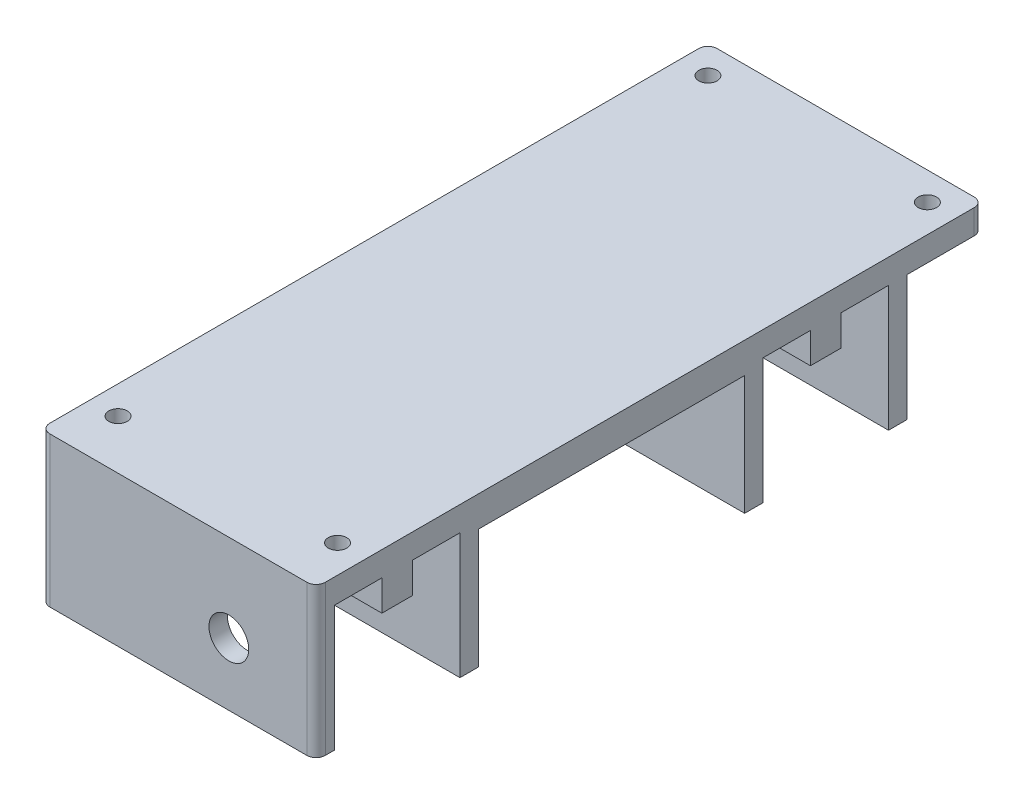
ISO-10303-21;
HEADER;
FILE_DESCRIPTION(('STEP AP214'),'2;1');
FILE_NAME('part.step','',(''),(''),'','','');
FILE_SCHEMA(('AUTOMOTIVE_DESIGN { 1 0 10303 214 1 1 1 1 }'));
ENDSEC;
DATA;
#1=APPLICATION_CONTEXT('core data for automotive mechanical design processes');
#2=APPLICATION_PROTOCOL_DEFINITION('international standard','automotive_design',2000,#1);
#3=PRODUCT_CONTEXT('',#1,'mechanical');
#4=PRODUCT('Part','Part','',(#3));
#5=PRODUCT_RELATED_PRODUCT_CATEGORY('part','',(#4));
#6=PRODUCT_DEFINITION_FORMATION('','',#4);
#7=PRODUCT_DEFINITION_CONTEXT('part definition',#1,'design');
#8=PRODUCT_DEFINITION('design','',#6,#7);
#9=PRODUCT_DEFINITION_SHAPE('','',#8);
#10=(LENGTH_UNIT() NAMED_UNIT(*) SI_UNIT(.MILLI.,.METRE.));
#11=(NAMED_UNIT(*) PLANE_ANGLE_UNIT() SI_UNIT($,.RADIAN.));
#12=(NAMED_UNIT(*) SI_UNIT($,.STERADIAN.) SOLID_ANGLE_UNIT());
#13=UNCERTAINTY_MEASURE_WITH_UNIT(LENGTH_MEASURE(1.E-05),#10,'distance_accuracy_value','');
#14=(GEOMETRIC_REPRESENTATION_CONTEXT(3) GLOBAL_UNCERTAINTY_ASSIGNED_CONTEXT((#13)) GLOBAL_UNIT_ASSIGNED_CONTEXT((#10,
#11,#12)) REPRESENTATION_CONTEXT('',''));
#15=CARTESIAN_POINT('',(0.,0.,0.));
#16=DIRECTION('',(0.,0.,1.));
#17=DIRECTION('',(1.,0.,0.));
#18=AXIS2_PLACEMENT_3D('',#15,#16,#17);
#19=CARTESIAN_POINT('',(22.5,-4.,53.));
#20=DIRECTION('',(1.,0.,0.));
#21=DIRECTION('',(0.,0.,-1.));
#22=AXIS2_PLACEMENT_3D('',#19,#20,#21);
#23=PLANE('',#22);
#24=DIRECTION('',(0.,0.,1.));
#25=VECTOR('',#24,1.);
#26=CARTESIAN_POINT('',(22.5,-5.,-15.5));
#27=LINE('',#26,#25);
#28=CARTESIAN_POINT('',(22.5,-5.,-15.5));
#29=VERTEX_POINT('',#28);
#30=CARTESIAN_POINT('',(22.5,-5.,28.));
#31=VERTEX_POINT('',#30);
#32=EDGE_CURVE('E61',#29,#31,#27,.T.);
#33=ORIENTED_EDGE('',*,*,#32,.F.);
#34=DIRECTION('',(0.,1.,0.));
#35=VECTOR('',#34,1.);
#36=CARTESIAN_POINT('',(22.5,-24.5,-15.5));
#37=LINE('',#36,#35);
#38=CARTESIAN_POINT('',(22.5,-24.5,-15.5));
#39=VERTEX_POINT('',#38);
#40=EDGE_CURVE('E430',#39,#29,#37,.T.);
#41=ORIENTED_EDGE('',*,*,#40,.F.);
#42=DIRECTION('',(0.,0.,1.));
#43=VECTOR('',#42,1.);
#44=CARTESIAN_POINT('',(22.5,-24.5,0.));
#45=LINE('',#44,#43);
#46=CARTESIAN_POINT('',(22.5,-24.5,-18.5));
#47=VERTEX_POINT('',#46);
#48=EDGE_CURVE('E418',#47,#39,#45,.T.);
#49=ORIENTED_EDGE('',*,*,#48,.F.);
#50=DIRECTION('',(0.,1.,0.));
#51=VECTOR('',#50,1.);
#52=CARTESIAN_POINT('',(22.5,-24.5,-18.5));
#53=LINE('',#52,#51);
#54=CARTESIAN_POINT('',(22.5,-4.,-18.5));
#55=VERTEX_POINT('',#54);
#56=EDGE_CURVE('E434',#47,#55,#53,.T.);
#57=ORIENTED_EDGE('',*,*,#56,.T.);
#58=DIRECTION('',(0.,0.,-1.));
#59=VECTOR('',#58,1.);
#60=CARTESIAN_POINT('',(22.5,-4.,53.));
#61=LINE('',#60,#59);
#62=CARTESIAN_POINT('',(22.5,-4.,-26.25));
#63=VERTEX_POINT('',#62);
#64=EDGE_CURVE('E502',#55,#63,#61,.T.);
#65=ORIENTED_EDGE('',*,*,#64,.T.);
#66=DIRECTION('',(0.,1.,0.));
#67=VECTOR('',#66,1.);
#68=CARTESIAN_POINT('',(22.5,-24.5,-26.25));
#69=LINE('',#68,#67);
#70=CARTESIAN_POINT('',(22.5,-9.,-26.25));
#71=VERTEX_POINT('',#70);
#72=EDGE_CURVE('E396',#71,#63,#69,.T.);
#73=ORIENTED_EDGE('',*,*,#72,.F.);
#74=DIRECTION('',(0.,0.,1.));
#75=VECTOR('',#74,1.);
#76=CARTESIAN_POINT('',(22.5,-9.,-31.25));
#77=LINE('',#76,#75);
#78=CARTESIAN_POINT('',(22.5,-9.,-31.25));
#79=VERTEX_POINT('',#78);
#80=EDGE_CURVE('E69',#79,#71,#77,.T.);
#81=ORIENTED_EDGE('',*,*,#80,.F.);
#82=DIRECTION('',(0.,1.,0.));
#83=VECTOR('',#82,1.);
#84=CARTESIAN_POINT('',(22.5,-24.5,-31.25));
#85=LINE('',#84,#83);
#86=CARTESIAN_POINT('',(22.5,-4.,-31.25));
#87=VERTEX_POINT('',#86);
#88=EDGE_CURVE('E393',#79,#87,#85,.T.);
#89=ORIENTED_EDGE('',*,*,#88,.T.);
#90=CARTESIAN_POINT('',(22.5,-4.,-39.));
#91=VERTEX_POINT('',#90);
#92=EDGE_CURVE('E638',#87,#91,#61,.T.);
#93=ORIENTED_EDGE('',*,*,#92,.T.);
#94=DIRECTION('',(0.,1.,0.));
#95=VECTOR('',#94,1.);
#96=CARTESIAN_POINT('',(22.5,-24.5,-39.));
#97=LINE('',#96,#95);
#98=CARTESIAN_POINT('',(22.5,-24.5,-39.));
#99=VERTEX_POINT('',#98);
#100=EDGE_CURVE('E362',#99,#91,#97,.T.);
#101=ORIENTED_EDGE('',*,*,#100,.F.);
#102=DIRECTION('',(0.,0.,1.));
#103=VECTOR('',#102,1.);
#104=CARTESIAN_POINT('',(22.5,-24.5,0.));
#105=LINE('',#104,#103);
#106=CARTESIAN_POINT('',(22.5,-24.5,-42.));
#107=VERTEX_POINT('',#106);
#108=EDGE_CURVE('E382',#107,#99,#105,.T.);
#109=ORIENTED_EDGE('',*,*,#108,.F.);
#110=DIRECTION('',(0.,1.,0.));
#111=VECTOR('',#110,1.);
#112=CARTESIAN_POINT('',(22.5,-24.5,-42.));
#113=LINE('',#112,#111);
#114=CARTESIAN_POINT('',(22.5,-4.,-42.));
#115=VERTEX_POINT('',#114);
#116=EDGE_CURVE('E358',#107,#115,#113,.T.);
#117=ORIENTED_EDGE('',*,*,#116,.T.);
#118=CARTESIAN_POINT('',(22.5,-4.,-53.));
#119=VERTEX_POINT('',#118);
#120=EDGE_CURVE('E493',#115,#119,#61,.T.);
#121=ORIENTED_EDGE('',*,*,#120,.T.);
#122=DIRECTION('',(0.,1.,0.));
#123=VECTOR('',#122,1.);
#124=CARTESIAN_POINT('',(22.5,-4.,-53.));
#125=LINE('',#124,#123);
#126=CARTESIAN_POINT('',(22.5,0.,-53.));
#127=VERTEX_POINT('',#126);
#128=EDGE_CURVE('E11',#119,#127,#125,.T.);
#129=ORIENTED_EDGE('',*,*,#128,.T.);
#130=DIRECTION('',(0.,0.,-1.));
#131=VECTOR('',#130,1.);
#132=CARTESIAN_POINT('',(22.5,0.,53.));
#133=LINE('',#132,#131);
#134=CARTESIAN_POINT('',(22.5,0.,53.));
#135=VERTEX_POINT('',#134);
#136=EDGE_CURVE('E480',#135,#127,#133,.T.);
#137=ORIENTED_EDGE('',*,*,#136,.F.);
#138=DIRECTION('',(0.,1.,0.));
#139=VECTOR('',#138,1.);
#140=CARTESIAN_POINT('',(22.5,-4.,53.));
#141=LINE('',#140,#139);
#142=CARTESIAN_POINT('',(22.5,-24.5,53.));
#143=VERTEX_POINT('',#142);
#144=EDGE_CURVE('E53',#143,#135,#141,.T.);
#145=ORIENTED_EDGE('',*,*,#144,.F.);
#146=DIRECTION('',(0.,0.,1.));
#147=VECTOR('',#146,1.);
#148=CARTESIAN_POINT('',(22.5,-24.5,0.));
#149=LINE('',#148,#147);
#150=CARTESIAN_POINT('',(22.5,-24.5,51.5));
#151=VERTEX_POINT('',#150);
#152=EDGE_CURVE('E329',#151,#143,#149,.T.);
#153=ORIENTED_EDGE('',*,*,#152,.F.);
#154=DIRECTION('',(0.,1.,0.));
#155=VECTOR('',#154,1.);
#156=CARTESIAN_POINT('',(22.5,-24.5,51.5));
#157=LINE('',#156,#155);
#158=CARTESIAN_POINT('',(22.5,-4.,51.5));
#159=VERTEX_POINT('',#158);
#160=EDGE_CURVE('E290',#151,#159,#157,.T.);
#161=ORIENTED_EDGE('',*,*,#160,.T.);
#162=CARTESIAN_POINT('',(22.5,-4.,43.75));
#163=VERTEX_POINT('',#162);
#164=EDGE_CURVE('E497',#159,#163,#61,.T.);
#165=ORIENTED_EDGE('',*,*,#164,.T.);
#166=DIRECTION('',(0.,1.,0.));
#167=VECTOR('',#166,1.);
#168=CARTESIAN_POINT('',(22.5,-24.5,43.75));
#169=LINE('',#168,#167);
#170=CARTESIAN_POINT('',(22.5,-9.,43.75));
#171=VERTEX_POINT('',#170);
#172=EDGE_CURVE('E341',#171,#163,#169,.T.);
#173=ORIENTED_EDGE('',*,*,#172,.F.);
#174=DIRECTION('',(0.,0.,1.));
#175=VECTOR('',#174,1.);
#176=CARTESIAN_POINT('',(22.5,-9.,38.75));
#177=LINE('',#176,#175);
#178=CARTESIAN_POINT('',(22.5,-9.,38.75));
#179=VERTEX_POINT('',#178);
#180=EDGE_CURVE('E268',#179,#171,#177,.T.);
#181=ORIENTED_EDGE('',*,*,#180,.F.);
#182=DIRECTION('',(0.,1.,0.));
#183=VECTOR('',#182,1.);
#184=CARTESIAN_POINT('',(22.5,-24.5,38.75));
#185=LINE('',#184,#183);
#186=CARTESIAN_POINT('',(22.5,-4.,38.75));
#187=VERTEX_POINT('',#186);
#188=EDGE_CURVE('E338',#179,#187,#185,.T.);
#189=ORIENTED_EDGE('',*,*,#188,.T.);
#190=CARTESIAN_POINT('',(22.5,-4.,31.));
#191=VERTEX_POINT('',#190);
#192=EDGE_CURVE('E501',#187,#191,#61,.T.);
#193=ORIENTED_EDGE('',*,*,#192,.T.);
#194=DIRECTION('',(0.,1.,0.));
#195=VECTOR('',#194,1.);
#196=CARTESIAN_POINT('',(22.5,-24.5,31.));
#197=LINE('',#196,#195);
#198=CARTESIAN_POINT('',(22.5,-24.5,31.));
#199=VERTEX_POINT('',#198);
#200=EDGE_CURVE('E272',#199,#191,#197,.T.);
#201=ORIENTED_EDGE('',*,*,#200,.F.);
#202=DIRECTION('',(0.,0.,-1.));
#203=VECTOR('',#202,1.);
#204=CARTESIAN_POINT('',(22.5,-24.5,31.));
#205=LINE('',#204,#203);
#206=CARTESIAN_POINT('',(22.5,-24.5,28.));
#207=VERTEX_POINT('',#206);
#208=EDGE_CURVE('E295',#199,#207,#205,.T.);
#209=ORIENTED_EDGE('',*,*,#208,.T.);
#210=DIRECTION('',(0.,1.,0.));
#211=VECTOR('',#210,1.);
#212=CARTESIAN_POINT('',(22.5,-24.5,28.));
#213=LINE('',#212,#211);
#214=EDGE_CURVE('E267',#207,#31,#213,.T.);
#215=ORIENTED_EDGE('',*,*,#214,.T.);
#216=EDGE_LOOP('',(#33,#41,#49,#57,#65,#73,#81,#89,#93,#101,#109,#117,#121,#129,#137,#145,#153,
#161,#165,#173,#181,#189,#193,#201,#209,#215));
#217=FACE_BOUND('',#216,.T.);
#218=ADVANCED_FACE('F43',(#217),#23,.T.);
#219=CARTESIAN_POINT('',(-22.5,-4.,53.));
#220=DIRECTION('',(-1.,0.,0.));
#221=DIRECTION('',(0.,0.,1.));
#222=AXIS2_PLACEMENT_3D('',#219,#220,#221);
#223=PLANE('',#222);
#224=DIRECTION('',(0.,1.,0.));
#225=VECTOR('',#224,1.);
#226=CARTESIAN_POINT('',(-22.5,-4.,53.));
#227=LINE('',#226,#225);
#228=CARTESIAN_POINT('',(-22.5,-24.5,53.));
#229=VERTEX_POINT('',#228);
#230=CARTESIAN_POINT('',(-22.5,0.,53.));
#231=VERTEX_POINT('',#230);
#232=EDGE_CURVE('E539',#229,#231,#227,.T.);
#233=ORIENTED_EDGE('',*,*,#232,.T.);
#234=DIRECTION('',(0.,0.,1.));
#235=VECTOR('',#234,1.);
#236=CARTESIAN_POINT('',(-22.5,0.,53.));
#237=LINE('',#236,#235);
#238=CARTESIAN_POINT('',(-22.5,0.,-53.));
#239=VERTEX_POINT('',#238);
#240=EDGE_CURVE('E514',#239,#231,#237,.T.);
#241=ORIENTED_EDGE('',*,*,#240,.F.);
#242=DIRECTION('',(0.,1.,0.));
#243=VECTOR('',#242,1.);
#244=CARTESIAN_POINT('',(-22.5,-4.,-53.));
#245=LINE('',#244,#243);
#246=CARTESIAN_POINT('',(-22.5,-4.,-53.));
#247=VERTEX_POINT('',#246);
#248=EDGE_CURVE('E542',#247,#239,#245,.T.);
#249=ORIENTED_EDGE('',*,*,#248,.F.);
#250=DIRECTION('',(0.,0.,1.));
#251=VECTOR('',#250,1.);
#252=CARTESIAN_POINT('',(-22.5,-4.,53.));
#253=LINE('',#252,#251);
#254=CARTESIAN_POINT('',(-22.5,-4.,-42.));
#255=VERTEX_POINT('',#254);
#256=EDGE_CURVE('E489',#247,#255,#253,.T.);
#257=ORIENTED_EDGE('',*,*,#256,.T.);
#258=DIRECTION('',(0.,1.,0.));
#259=VECTOR('',#258,1.);
#260=CARTESIAN_POINT('',(-22.5,-24.5,-42.));
#261=LINE('',#260,#259);
#262=CARTESIAN_POINT('',(-22.5,-24.5,-42.));
#263=VERTEX_POINT('',#262);
#264=EDGE_CURVE('E355',#263,#255,#261,.T.);
#265=ORIENTED_EDGE('',*,*,#264,.F.);
#266=DIRECTION('',(0.,0.,-1.));
#267=VECTOR('',#266,1.);
#268=CARTESIAN_POINT('',(-22.5,-24.5,0.));
#269=LINE('',#268,#267);
#270=CARTESIAN_POINT('',(-22.5,-24.5,-39.));
#271=VERTEX_POINT('',#270);
#272=EDGE_CURVE('E375',#271,#263,#269,.T.);
#273=ORIENTED_EDGE('',*,*,#272,.F.);
#274=DIRECTION('',(0.,1.,0.));
#275=VECTOR('',#274,1.);
#276=CARTESIAN_POINT('',(-22.5,-24.5,-39.));
#277=LINE('',#276,#275);
#278=CARTESIAN_POINT('',(-22.5,-4.,-39.));
#279=VERTEX_POINT('',#278);
#280=EDGE_CURVE('E365',#271,#279,#277,.T.);
#281=ORIENTED_EDGE('',*,*,#280,.T.);
#282=CARTESIAN_POINT('',(-22.5,-4.,-31.25));
#283=VERTEX_POINT('',#282);
#284=EDGE_CURVE('E494',#279,#283,#253,.T.);
#285=ORIENTED_EDGE('',*,*,#284,.T.);
#286=DIRECTION('',(0.,1.,0.));
#287=VECTOR('',#286,1.);
#288=CARTESIAN_POINT('',(-22.5,-24.5,-31.25));
#289=LINE('',#288,#287);
#290=CARTESIAN_POINT('',(-22.5,-9.,-31.25));
#291=VERTEX_POINT('',#290);
#292=EDGE_CURVE('E378',#291,#283,#289,.T.);
#293=ORIENTED_EDGE('',*,*,#292,.F.);
#294=DIRECTION('',(0.,0.,-1.));
#295=VECTOR('',#294,1.);
#296=CARTESIAN_POINT('',(-22.5,-9.,-26.25));
#297=LINE('',#296,#295);
#298=CARTESIAN_POINT('',(-22.5,-9.,-26.25));
#299=VERTEX_POINT('',#298);
#300=EDGE_CURVE('E620',#299,#291,#297,.T.);
#301=ORIENTED_EDGE('',*,*,#300,.F.);
#302=DIRECTION('',(0.,1.,0.));
#303=VECTOR('',#302,1.);
#304=CARTESIAN_POINT('',(-22.5,-24.5,-26.25));
#305=LINE('',#304,#303);
#306=CARTESIAN_POINT('',(-22.5,-4.,-26.25));
#307=VERTEX_POINT('',#306);
#308=EDGE_CURVE('E399',#299,#307,#305,.T.);
#309=ORIENTED_EDGE('',*,*,#308,.T.);
#310=CARTESIAN_POINT('',(-22.5,-4.,-18.5));
#311=VERTEX_POINT('',#310);
#312=EDGE_CURVE('E496',#307,#311,#253,.T.);
#313=ORIENTED_EDGE('',*,*,#312,.T.);
#314=DIRECTION('',(0.,1.,0.));
#315=VECTOR('',#314,1.);
#316=CARTESIAN_POINT('',(-22.5,-24.5,-18.5));
#317=LINE('',#316,#315);
#318=CARTESIAN_POINT('',(-22.5,-24.5,-18.5));
#319=VERTEX_POINT('',#318);
#320=EDGE_CURVE('E438',#319,#311,#317,.T.);
#321=ORIENTED_EDGE('',*,*,#320,.F.);
#322=DIRECTION('',(0.,0.,-1.));
#323=VECTOR('',#322,1.);
#324=CARTESIAN_POINT('',(-22.5,-24.5,0.));
#325=LINE('',#324,#323);
#326=CARTESIAN_POINT('',(-22.5,-24.5,-15.5));
#327=VERTEX_POINT('',#326);
#328=EDGE_CURVE('E411',#327,#319,#325,.T.);
#329=ORIENTED_EDGE('',*,*,#328,.F.);
#330=DIRECTION('',(0.,1.,0.));
#331=VECTOR('',#330,1.);
#332=CARTESIAN_POINT('',(-22.5,-24.5,-15.5));
#333=LINE('',#332,#331);
#334=CARTESIAN_POINT('',(-22.5,-5.,-15.5));
#335=VERTEX_POINT('',#334);
#336=EDGE_CURVE('E259',#327,#335,#333,.T.);
#337=ORIENTED_EDGE('',*,*,#336,.T.);
#338=DIRECTION('',(0.,0.,-1.));
#339=VECTOR('',#338,1.);
#340=CARTESIAN_POINT('',(-22.5,-5.,28.));
#341=LINE('',#340,#339);
#342=CARTESIAN_POINT('',(-22.5,-5.,28.));
#343=VERTEX_POINT('',#342);
#344=EDGE_CURVE('E243',#343,#335,#341,.T.);
#345=ORIENTED_EDGE('',*,*,#344,.F.);
#346=DIRECTION('',(0.,1.,0.));
#347=VECTOR('',#346,1.);
#348=CARTESIAN_POINT('',(-22.5,-24.5,28.));
#349=LINE('',#348,#347);
#350=CARTESIAN_POINT('',(-22.5,-24.5,28.));
#351=VERTEX_POINT('',#350);
#352=EDGE_CURVE('E257',#351,#343,#349,.T.);
#353=ORIENTED_EDGE('',*,*,#352,.F.);
#354=DIRECTION('',(0.,0.,-1.));
#355=VECTOR('',#354,1.);
#356=CARTESIAN_POINT('',(-22.5,-24.5,31.));
#357=LINE('',#356,#355);
#358=CARTESIAN_POINT('',(-22.5,-24.5,31.));
#359=VERTEX_POINT('',#358);
#360=EDGE_CURVE('E291',#359,#351,#357,.T.);
#361=ORIENTED_EDGE('',*,*,#360,.F.);
#362=DIRECTION('',(0.,1.,0.));
#363=VECTOR('',#362,1.);
#364=CARTESIAN_POINT('',(-22.5,-24.5,31.));
#365=LINE('',#364,#363);
#366=CARTESIAN_POINT('',(-22.5,-4.,31.));
#367=VERTEX_POINT('',#366);
#368=EDGE_CURVE('E281',#359,#367,#365,.T.);
#369=ORIENTED_EDGE('',*,*,#368,.T.);
#370=CARTESIAN_POINT('',(-22.5,-4.,38.75));
#371=VERTEX_POINT('',#370);
#372=EDGE_CURVE('E495',#367,#371,#253,.T.);
#373=ORIENTED_EDGE('',*,*,#372,.T.);
#374=DIRECTION('',(0.,1.,0.));
#375=VECTOR('',#374,1.);
#376=CARTESIAN_POINT('',(-22.5,-24.5,38.75));
#377=LINE('',#376,#375);
#378=CARTESIAN_POINT('',(-22.5,-9.,38.75));
#379=VERTEX_POINT('',#378);
#380=EDGE_CURVE('E313',#379,#371,#377,.T.);
#381=ORIENTED_EDGE('',*,*,#380,.F.);
#382=DIRECTION('',(0.,0.,-1.));
#383=VECTOR('',#382,1.);
#384=CARTESIAN_POINT('',(-22.5,-9.,43.75));
#385=LINE('',#384,#383);
#386=CARTESIAN_POINT('',(-22.5,-9.,43.75));
#387=VERTEX_POINT('',#386);
#388=EDGE_CURVE('E607',#387,#379,#385,.T.);
#389=ORIENTED_EDGE('',*,*,#388,.F.);
#390=DIRECTION('',(0.,1.,0.));
#391=VECTOR('',#390,1.);
#392=CARTESIAN_POINT('',(-22.5,-24.5,43.75));
#393=LINE('',#392,#391);
#394=CARTESIAN_POINT('',(-22.5,-4.,43.75));
#395=VERTEX_POINT('',#394);
#396=EDGE_CURVE('E344',#387,#395,#393,.T.);
#397=ORIENTED_EDGE('',*,*,#396,.T.);
#398=CARTESIAN_POINT('',(-22.5,-4.,51.5));
#399=VERTEX_POINT('',#398);
#400=EDGE_CURVE('E488',#395,#399,#253,.T.);
#401=ORIENTED_EDGE('',*,*,#400,.T.);
#402=DIRECTION('',(0.,1.,0.));
#403=VECTOR('',#402,1.);
#404=CARTESIAN_POINT('',(-22.5,-24.5,51.5));
#405=LINE('',#404,#403);
#406=CARTESIAN_POINT('',(-22.5,-24.5,51.5));
#407=VERTEX_POINT('',#406);
#408=EDGE_CURVE('E305',#407,#399,#405,.T.);
#409=ORIENTED_EDGE('',*,*,#408,.F.);
#410=DIRECTION('',(0.,0.,-1.));
#411=VECTOR('',#410,1.);
#412=CARTESIAN_POINT('',(-22.5,-24.5,0.));
#413=LINE('',#412,#411);
#414=EDGE_CURVE('E308',#229,#407,#413,.T.);
#415=ORIENTED_EDGE('',*,*,#414,.F.);
#416=EDGE_LOOP('',(#233,#241,#249,#257,#265,#273,#281,#285,#293,#301,#309,#313,#321,#329,#337,
#345,#353,#361,#369,#373,#381,#389,#397,#401,#409,#415));
#417=FACE_BOUND('',#416,.T.);
#418=ADVANCED_FACE('F255',(#417),#223,.T.);
#419=CARTESIAN_POINT('',(0.,-24.5,-31.25));
#420=DIRECTION('',(0.,0.,1.));
#421=DIRECTION('',(1.,0.,0.));
#422=AXIS2_PLACEMENT_3D('',#419,#420,#421);
#423=PLANE('',#422);
#424=DIRECTION('',(1.,0.,0.));
#425=VECTOR('',#424,1.);
#426=CARTESIAN_POINT('',(-22.5,-9.,-31.25));
#427=LINE('',#426,#425);
#428=EDGE_CURVE('E612',#291,#79,#427,.T.);
#429=ORIENTED_EDGE('',*,*,#428,.F.);
#430=ORIENTED_EDGE('',*,*,#292,.T.);
#431=DIRECTION('',(1.,0.,0.));
#432=VECTOR('',#431,1.);
#433=CARTESIAN_POINT('',(0.,-4.,-31.25));
#434=LINE('',#433,#432);
#435=EDGE_CURVE('E406',#283,#87,#434,.T.);
#436=ORIENTED_EDGE('',*,*,#435,.T.);
#437=ORIENTED_EDGE('',*,*,#88,.F.);
#438=EDGE_LOOP('',(#429,#430,#436,#437));
#439=FACE_BOUND('',#438,.T.);
#440=ADVANCED_FACE('F632',(#439),#423,.F.);
#441=CARTESIAN_POINT('',(0.,-24.5,-26.25));
#442=DIRECTION('',(0.,0.,1.));
#443=DIRECTION('',(1.,0.,0.));
#444=AXIS2_PLACEMENT_3D('',#441,#442,#443);
#445=PLANE('',#444);
#446=ORIENTED_EDGE('',*,*,#308,.F.);
#447=DIRECTION('',(-1.,0.,0.));
#448=VECTOR('',#447,1.);
#449=CARTESIAN_POINT('',(22.5,-9.,-26.25));
#450=LINE('',#449,#448);
#451=EDGE_CURVE('E617',#71,#299,#450,.T.);
#452=ORIENTED_EDGE('',*,*,#451,.F.);
#453=ORIENTED_EDGE('',*,*,#72,.T.);
#454=DIRECTION('',(1.,0.,0.));
#455=VECTOR('',#454,1.);
#456=CARTESIAN_POINT('',(0.,-4.,-26.25));
#457=LINE('',#456,#455);
#458=EDGE_CURVE('E402',#307,#63,#457,.T.);
#459=ORIENTED_EDGE('',*,*,#458,.F.);
#460=EDGE_LOOP('',(#446,#452,#453,#459));
#461=FACE_BOUND('',#460,.T.);
#462=ADVANCED_FACE('F681',(#461),#445,.T.);
#463=CARTESIAN_POINT('',(0.,-24.5,38.75));
#464=DIRECTION('',(0.,0.,1.));
#465=DIRECTION('',(1.,0.,0.));
#466=AXIS2_PLACEMENT_3D('',#463,#464,#465);
#467=PLANE('',#466);
#468=DIRECTION('',(1.,0.,0.));
#469=VECTOR('',#468,1.);
#470=CARTESIAN_POINT('',(-22.5,-9.,38.75));
#471=LINE('',#470,#469);
#472=EDGE_CURVE('E274',#379,#179,#471,.T.);
#473=ORIENTED_EDGE('',*,*,#472,.F.);
#474=ORIENTED_EDGE('',*,*,#380,.T.);
#475=DIRECTION('',(1.,0.,0.));
#476=VECTOR('',#475,1.);
#477=CARTESIAN_POINT('',(0.,-4.,38.75));
#478=LINE('',#477,#476);
#479=EDGE_CURVE('E351',#371,#187,#478,.T.);
#480=ORIENTED_EDGE('',*,*,#479,.T.);
#481=ORIENTED_EDGE('',*,*,#188,.F.);
#482=EDGE_LOOP('',(#473,#474,#480,#481));
#483=FACE_BOUND('',#482,.T.);
#484=ADVANCED_FACE('F690',(#483),#467,.F.);
#485=CARTESIAN_POINT('',(0.,-24.5,43.75));
#486=DIRECTION('',(0.,0.,1.));
#487=DIRECTION('',(1.,0.,0.));
#488=AXIS2_PLACEMENT_3D('',#485,#486,#487);
#489=PLANE('',#488);
#490=ORIENTED_EDGE('',*,*,#396,.F.);
#491=DIRECTION('',(-1.,0.,0.));
#492=VECTOR('',#491,1.);
#493=CARTESIAN_POINT('',(22.5,-9.,43.75));
#494=LINE('',#493,#492);
#495=EDGE_CURVE('E603',#171,#387,#494,.T.);
#496=ORIENTED_EDGE('',*,*,#495,.F.);
#497=ORIENTED_EDGE('',*,*,#172,.T.);
#498=DIRECTION('',(1.,0.,0.));
#499=VECTOR('',#498,1.);
#500=CARTESIAN_POINT('',(0.,-4.,43.75));
#501=LINE('',#500,#499);
#502=EDGE_CURVE('E347',#395,#163,#501,.T.);
#503=ORIENTED_EDGE('',*,*,#502,.F.);
#504=EDGE_LOOP('',(#490,#496,#497,#503));
#505=FACE_BOUND('',#504,.T.);
#506=ADVANCED_FACE('F601',(#505),#489,.T.);
#507=CARTESIAN_POINT('',(21.,-4.,-53.));
#508=DIRECTION('',(0.,1.,0.));
#509=DIRECTION('',(0.,0.,1.));
#510=AXIS2_PLACEMENT_3D('',#507,#508,#509);
#511=PLANE('',#510);
#512=ORIENTED_EDGE('',*,*,#372,.F.);
#513=DIRECTION('',(1.,0.,0.));
#514=VECTOR('',#513,1.);
#515=CARTESIAN_POINT('',(-22.5,-4.,31.));
#516=LINE('',#515,#514);
#517=EDGE_CURVE('E286',#367,#191,#516,.T.);
#518=ORIENTED_EDGE('',*,*,#517,.T.);
#519=ORIENTED_EDGE('',*,*,#192,.F.);
#520=ORIENTED_EDGE('',*,*,#479,.F.);
#521=EDGE_LOOP('',(#512,#518,#519,#520));
#522=FACE_BOUND('',#521,.T.);
#523=ADVANCED_FACE('F652',(#522),#511,.F.);
#524=CARTESIAN_POINT('',(17.925,-4.,-49.925));
#525=DIRECTION('',(0.,1.,0.));
#526=DIRECTION('',(0.,0.,1.));
#527=AXIS2_PLACEMENT_3D('',#524,#525,#526);
#528=CIRCLE('',#527,1.5);
#529=CARTESIAN_POINT('',(17.925,-4.,-48.425));
#530=VERTEX_POINT('',#529);
#531=EDGE_CURVE('E451',#530,#530,#528,.T.);
#532=ORIENTED_EDGE('',*,*,#531,.T.);
#533=EDGE_LOOP('',(#532));
#534=FACE_BOUND('',#533,.T.);
#535=CARTESIAN_POINT('',(-17.925,-4.,-49.925));
#536=DIRECTION('',(0.,1.,0.));
#537=DIRECTION('',(0.,0.,1.));
#538=AXIS2_PLACEMENT_3D('',#535,#536,#537);
#539=CIRCLE('',#538,1.5);
#540=CARTESIAN_POINT('',(-17.925,-4.,-48.425));
#541=VERTEX_POINT('',#540);
#542=EDGE_CURVE('E443',#541,#541,#539,.T.);
#543=ORIENTED_EDGE('',*,*,#542,.T.);
#544=EDGE_LOOP('',(#543));
#545=FACE_BOUND('',#544,.T.);
#546=DIRECTION('',(1.,0.,0.));
#547=VECTOR('',#546,1.);
#548=CARTESIAN_POINT('',(0.,-4.,-42.));
#549=LINE('',#548,#547);
#550=EDGE_CURVE('E374',#255,#115,#549,.T.);
#551=ORIENTED_EDGE('',*,*,#550,.F.);
#552=ORIENTED_EDGE('',*,*,#256,.F.);
#553=CARTESIAN_POINT('',(-21.,-4.,-53.));
#554=DIRECTION('',(0.,1.,0.));
#555=DIRECTION('',(0.,0.,1.));
#556=AXIS2_PLACEMENT_3D('',#553,#554,#555);
#557=CIRCLE('',#556,1.5);
#558=CARTESIAN_POINT('',(-21.,-4.,-54.5));
#559=VERTEX_POINT('',#558);
#560=EDGE_CURVE('E484',#559,#247,#557,.T.);
#561=ORIENTED_EDGE('',*,*,#560,.F.);
#562=DIRECTION('',(-1.,0.,0.));
#563=VECTOR('',#562,1.);
#564=CARTESIAN_POINT('',(21.,-4.,-54.5));
#565=LINE('',#564,#563);
#566=CARTESIAN_POINT('',(21.,-4.,-54.5));
#567=VERTEX_POINT('',#566);
#568=EDGE_CURVE('E479',#567,#559,#565,.T.);
#569=ORIENTED_EDGE('',*,*,#568,.F.);
#570=CARTESIAN_POINT('',(21.,-4.,-53.));
#571=DIRECTION('',(0.,1.,0.));
#572=DIRECTION('',(0.,0.,1.));
#573=AXIS2_PLACEMENT_3D('',#570,#571,#572);
#574=CIRCLE('',#573,1.5);
#575=EDGE_CURVE('E475',#119,#567,#574,.T.);
#576=ORIENTED_EDGE('',*,*,#575,.F.);
#577=ORIENTED_EDGE('',*,*,#120,.F.);
#578=EDGE_LOOP('',(#551,#552,#561,#569,#576,#577));
#579=FACE_BOUND('',#578,.T.);
#580=ADVANCED_FACE('F565',(#534,#545,#579),#511,.F.);
#581=ORIENTED_EDGE('',*,*,#284,.F.);
#582=DIRECTION('',(1.,0.,0.));
#583=VECTOR('',#582,1.);
#584=CARTESIAN_POINT('',(0.,-4.,-39.));
#585=LINE('',#584,#583);
#586=EDGE_CURVE('E370',#279,#91,#585,.T.);
#587=ORIENTED_EDGE('',*,*,#586,.T.);
#588=ORIENTED_EDGE('',*,*,#92,.F.);
#589=ORIENTED_EDGE('',*,*,#435,.F.);
#590=EDGE_LOOP('',(#581,#587,#588,#589));
#591=FACE_BOUND('',#590,.T.);
#592=ADVANCED_FACE('F639',(#591),#511,.F.);
#593=ORIENTED_EDGE('',*,*,#312,.F.);
#594=ORIENTED_EDGE('',*,*,#458,.T.);
#595=ORIENTED_EDGE('',*,*,#64,.F.);
#596=DIRECTION('',(1.,0.,0.));
#597=VECTOR('',#596,1.);
#598=CARTESIAN_POINT('',(0.,-4.,-18.5));
#599=LINE('',#598,#597);
#600=EDGE_CURVE('E410',#311,#55,#599,.T.);
#601=ORIENTED_EDGE('',*,*,#600,.F.);
#602=EDGE_LOOP('',(#593,#594,#595,#601));
#603=FACE_BOUND('',#602,.T.);
#604=ADVANCED_FACE('F677',(#603),#511,.F.);
#605=CARTESIAN_POINT('',(21.,-4.,-53.));
#606=DIRECTION('',(0.,1.,0.));
#607=DIRECTION('',(0.,0.,1.));
#608=AXIS2_PLACEMENT_3D('',#605,#606,#607);
#609=CYLINDRICAL_SURFACE('',#608,1.5);
#610=CARTESIAN_POINT('',(21.,0.,-53.));
#611=DIRECTION('',(0.,1.,0.));
#612=DIRECTION('',(0.,0.,1.));
#613=AXIS2_PLACEMENT_3D('',#610,#611,#612);
#614=CIRCLE('',#613,1.5);
#615=CARTESIAN_POINT('',(21.,0.,-54.5));
#616=VERTEX_POINT('',#615);
#617=EDGE_CURVE('E471',#127,#616,#614,.T.);
#618=ORIENTED_EDGE('',*,*,#617,.F.);
#619=ORIENTED_EDGE('',*,*,#128,.F.);
#620=ORIENTED_EDGE('',*,*,#575,.T.);
#621=DIRECTION('',(0.,1.,0.));
#622=VECTOR('',#621,1.);
#623=CARTESIAN_POINT('',(21.,-4.,-54.5));
#624=LINE('',#623,#622);
#625=EDGE_CURVE('E47',#567,#616,#624,.T.);
#626=ORIENTED_EDGE('',*,*,#625,.T.);
#627=EDGE_LOOP('',(#618,#619,#620,#626));
#628=FACE_BOUND('',#627,.T.);
#629=ADVANCED_FACE('F45',(#628),#609,.T.);
#630=CARTESIAN_POINT('',(21.,-4.,53.));
#631=DIRECTION('',(0.,1.,0.));
#632=DIRECTION('',(0.,0.,1.));
#633=AXIS2_PLACEMENT_3D('',#630,#631,#632);
#634=CYLINDRICAL_SURFACE('',#633,1.5);
#635=CARTESIAN_POINT('',(21.,0.,53.));
#636=DIRECTION('',(0.,1.,0.));
#637=DIRECTION('',(0.,0.,1.));
#638=AXIS2_PLACEMENT_3D('',#635,#636,#637);
#639=CIRCLE('',#638,1.5);
#640=CARTESIAN_POINT('',(21.,0.,54.5));
#641=VERTEX_POINT('',#640);
#642=EDGE_CURVE('E525',#641,#135,#639,.T.);
#643=ORIENTED_EDGE('',*,*,#642,.F.);
#644=DIRECTION('',(0.,1.,0.));
#645=VECTOR('',#644,1.);
#646=CARTESIAN_POINT('',(21.,-4.,54.5));
#647=LINE('',#646,#645);
#648=CARTESIAN_POINT('',(21.,-24.5,54.5));
#649=VERTEX_POINT('',#648);
#650=EDGE_CURVE('E533',#649,#641,#647,.T.);
#651=ORIENTED_EDGE('',*,*,#650,.F.);
#652=CARTESIAN_POINT('',(21.,-24.5,53.));
#653=DIRECTION('',(0.,-1.,0.));
#654=DIRECTION('',(0.,0.,-1.));
#655=AXIS2_PLACEMENT_3D('',#652,#653,#654);
#656=CIRCLE('',#655,1.5);
#657=EDGE_CURVE('E325',#143,#649,#656,.T.);
#658=ORIENTED_EDGE('',*,*,#657,.F.);
#659=ORIENTED_EDGE('',*,*,#144,.T.);
#660=EDGE_LOOP('',(#643,#651,#658,#659));
#661=FACE_BOUND('',#660,.T.);
#662=ADVANCED_FACE('F583',(#661),#634,.T.);
#663=CARTESIAN_POINT('',(21.,-4.,54.5));
#664=DIRECTION('',(0.,0.,1.));
#665=DIRECTION('',(1.,0.,0.));
#666=AXIS2_PLACEMENT_3D('',#663,#664,#665);
#667=PLANE('',#666);
#668=CARTESIAN_POINT('',(8.25,-14.25,54.5));
#669=DIRECTION('',(0.,0.,1.));
#670=DIRECTION('',(1.,0.,0.));
#671=AXIS2_PLACEMENT_3D('',#668,#669,#670);
#672=CIRCLE('',#671,3.25);
#673=CARTESIAN_POINT('',(11.5,-14.25,54.5));
#674=VERTEX_POINT('',#673);
#675=EDGE_CURVE('E1135',#674,#674,#672,.T.);
#676=ORIENTED_EDGE('',*,*,#675,.F.);
#677=EDGE_LOOP('',(#676));
#678=FACE_BOUND('',#677,.T.);
#679=DIRECTION('',(1.,0.,0.));
#680=VECTOR('',#679,1.);
#681=CARTESIAN_POINT('',(21.,0.,54.5));
#682=LINE('',#681,#680);
#683=CARTESIAN_POINT('',(-21.,0.,54.5));
#684=VERTEX_POINT('',#683);
#685=EDGE_CURVE('E521',#684,#641,#682,.T.);
#686=ORIENTED_EDGE('',*,*,#685,.F.);
#687=DIRECTION('',(0.,1.,0.));
#688=VECTOR('',#687,1.);
#689=CARTESIAN_POINT('',(-21.,-4.,54.5));
#690=LINE('',#689,#688);
#691=CARTESIAN_POINT('',(-21.,-24.5,54.5));
#692=VERTEX_POINT('',#691);
#693=EDGE_CURVE('E536',#692,#684,#690,.T.);
#694=ORIENTED_EDGE('',*,*,#693,.F.);
#695=DIRECTION('',(-1.,0.,0.));
#696=VECTOR('',#695,1.);
#697=CARTESIAN_POINT('',(0.,-24.5,54.5));
#698=LINE('',#697,#696);
#699=EDGE_CURVE('E321',#649,#692,#698,.T.);
#700=ORIENTED_EDGE('',*,*,#699,.F.);
#701=ORIENTED_EDGE('',*,*,#650,.T.);
#702=EDGE_LOOP('',(#686,#694,#700,#701));
#703=FACE_BOUND('',#702,.T.);
#704=ADVANCED_FACE('F580',(#678,#703),#667,.T.);
#705=CARTESIAN_POINT('',(-21.,-4.,53.));
#706=DIRECTION('',(0.,1.,0.));
#707=DIRECTION('',(0.,0.,1.));
#708=AXIS2_PLACEMENT_3D('',#705,#706,#707);
#709=CYLINDRICAL_SURFACE('',#708,1.5);
#710=CARTESIAN_POINT('',(-21.,0.,53.));
#711=DIRECTION('',(0.,1.,0.));
#712=DIRECTION('',(0.,0.,-1.));
#713=AXIS2_PLACEMENT_3D('',#710,#711,#712);
#714=CIRCLE('',#713,1.5);
#715=EDGE_CURVE('E517',#231,#684,#714,.T.);
#716=ORIENTED_EDGE('',*,*,#715,.F.);
#717=ORIENTED_EDGE('',*,*,#232,.F.);
#718=CARTESIAN_POINT('',(-21.,-24.5,53.));
#719=DIRECTION('',(0.,-1.,0.));
#720=DIRECTION('',(0.,0.,-1.));
#721=AXIS2_PLACEMENT_3D('',#718,#719,#720);
#722=CIRCLE('',#721,1.5);
#723=EDGE_CURVE('E317',#692,#229,#722,.T.);
#724=ORIENTED_EDGE('',*,*,#723,.F.);
#725=ORIENTED_EDGE('',*,*,#693,.T.);
#726=EDGE_LOOP('',(#716,#717,#724,#725));
#727=FACE_BOUND('',#726,.T.);
#728=ADVANCED_FACE('F576',(#727),#709,.T.);
#729=CARTESIAN_POINT('',(-21.,-4.,-53.));
#730=DIRECTION('',(0.,1.,0.));
#731=DIRECTION('',(0.,0.,1.));
#732=AXIS2_PLACEMENT_3D('',#729,#730,#731);
#733=CYLINDRICAL_SURFACE('',#732,1.5);
#734=CARTESIAN_POINT('',(-21.,0.,-53.));
#735=DIRECTION('',(0.,1.,0.));
#736=DIRECTION('',(0.,0.,1.));
#737=AXIS2_PLACEMENT_3D('',#734,#735,#736);
#738=CIRCLE('',#737,1.5);
#739=CARTESIAN_POINT('',(-21.,0.,-54.5));
#740=VERTEX_POINT('',#739);
#741=EDGE_CURVE('E510',#740,#239,#738,.T.);
#742=ORIENTED_EDGE('',*,*,#741,.F.);
#743=DIRECTION('',(0.,1.,0.));
#744=VECTOR('',#743,1.);
#745=CARTESIAN_POINT('',(-21.,-4.,-54.5));
#746=LINE('',#745,#744);
#747=EDGE_CURVE('E544',#559,#740,#746,.T.);
#748=ORIENTED_EDGE('',*,*,#747,.F.);
#749=ORIENTED_EDGE('',*,*,#560,.T.);
#750=ORIENTED_EDGE('',*,*,#248,.T.);
#751=EDGE_LOOP('',(#742,#748,#749,#750));
#752=FACE_BOUND('',#751,.T.);
#753=ADVANCED_FACE('F569',(#752),#733,.T.);
#754=CARTESIAN_POINT('',(21.,-4.,-54.5));
#755=DIRECTION('',(0.,0.,-1.));
#756=DIRECTION('',(-1.,0.,0.));
#757=AXIS2_PLACEMENT_3D('',#754,#755,#756);
#758=PLANE('',#757);
#759=DIRECTION('',(-1.,0.,0.));
#760=VECTOR('',#759,1.);
#761=CARTESIAN_POINT('',(21.,0.,-54.5));
#762=LINE('',#761,#760);
#763=EDGE_CURVE('E506',#616,#740,#762,.T.);
#764=ORIENTED_EDGE('',*,*,#763,.F.);
#765=ORIENTED_EDGE('',*,*,#625,.F.);
#766=ORIENTED_EDGE('',*,*,#568,.T.);
#767=ORIENTED_EDGE('',*,*,#747,.T.);
#768=EDGE_LOOP('',(#764,#765,#766,#767));
#769=FACE_BOUND('',#768,.T.);
#770=ADVANCED_FACE('F555',(#769),#758,.T.);
#771=CARTESIAN_POINT('',(-17.925,-4.,46.425));
#772=DIRECTION('',(0.,1.,0.));
#773=DIRECTION('',(0.,0.,1.));
#774=AXIS2_PLACEMENT_3D('',#771,#772,#773);
#775=CIRCLE('',#774,1.5);
#776=CARTESIAN_POINT('',(-17.925,-4.,47.925));
#777=VERTEX_POINT('',#776);
#778=EDGE_CURVE('E459',#777,#777,#775,.T.);
#779=ORIENTED_EDGE('',*,*,#778,.T.);
#780=EDGE_LOOP('',(#779));
#781=FACE_BOUND('',#780,.T.);
#782=CARTESIAN_POINT('',(17.925,-4.,46.425));
#783=DIRECTION('',(0.,1.,0.));
#784=DIRECTION('',(0.,0.,1.));
#785=AXIS2_PLACEMENT_3D('',#782,#783,#784);
#786=CIRCLE('',#785,1.5);
#787=CARTESIAN_POINT('',(17.925,-4.,47.925));
#788=VERTEX_POINT('',#787);
#789=EDGE_CURVE('E467',#788,#788,#786,.T.);
#790=ORIENTED_EDGE('',*,*,#789,.T.);
#791=EDGE_LOOP('',(#790));
#792=FACE_BOUND('',#791,.T.);
#793=ORIENTED_EDGE('',*,*,#164,.F.);
#794=DIRECTION('',(-1.,0.,0.));
#795=VECTOR('',#794,1.);
#796=CARTESIAN_POINT('',(0.,-4.,51.5));
#797=LINE('',#796,#795);
#798=EDGE_CURVE('E309',#159,#399,#797,.T.);
#799=ORIENTED_EDGE('',*,*,#798,.T.);
#800=ORIENTED_EDGE('',*,*,#400,.F.);
#801=ORIENTED_EDGE('',*,*,#502,.T.);
#802=EDGE_LOOP('',(#793,#799,#800,#801));
#803=FACE_BOUND('',#802,.T.);
#804=ADVANCED_FACE('F597',(#781,#792,#803),#511,.F.);
#805=CARTESIAN_POINT('',(21.,0.,-53.));
#806=DIRECTION('',(0.,1.,0.));
#807=DIRECTION('',(0.,0.,1.));
#808=AXIS2_PLACEMENT_3D('',#805,#806,#807);
#809=PLANE('',#808);
#810=ORIENTED_EDGE('',*,*,#136,.T.);
#811=ORIENTED_EDGE('',*,*,#617,.T.);
#812=ORIENTED_EDGE('',*,*,#763,.T.);
#813=ORIENTED_EDGE('',*,*,#741,.T.);
#814=ORIENTED_EDGE('',*,*,#240,.T.);
#815=ORIENTED_EDGE('',*,*,#715,.T.);
#816=ORIENTED_EDGE('',*,*,#685,.T.);
#817=ORIENTED_EDGE('',*,*,#642,.T.);
#818=EDGE_LOOP('',(#810,#811,#812,#813,#814,#815,#816,#817));
#819=FACE_BOUND('',#818,.T.);
#820=CARTESIAN_POINT('',(-17.925,0.,46.425));
#821=DIRECTION('',(0.,1.,0.));
#822=DIRECTION('',(0.,0.,1.));
#823=AXIS2_PLACEMENT_3D('',#820,#821,#822);
#824=CIRCLE('',#823,1.5);
#825=CARTESIAN_POINT('',(-17.925,0.,47.925));
#826=VERTEX_POINT('',#825);
#827=EDGE_CURVE('E455',#826,#826,#824,.T.);
#828=ORIENTED_EDGE('',*,*,#827,.F.);
#829=EDGE_LOOP('',(#828));
#830=FACE_BOUND('',#829,.T.);
#831=CARTESIAN_POINT('',(17.925,0.,46.425));
#832=DIRECTION('',(0.,1.,0.));
#833=DIRECTION('',(0.,0.,1.));
#834=AXIS2_PLACEMENT_3D('',#831,#832,#833);
#835=CIRCLE('',#834,1.5);
#836=CARTESIAN_POINT('',(17.925,0.,47.925));
#837=VERTEX_POINT('',#836);
#838=EDGE_CURVE('E463',#837,#837,#835,.T.);
#839=ORIENTED_EDGE('',*,*,#838,.F.);
#840=EDGE_LOOP('',(#839));
#841=FACE_BOUND('',#840,.T.);
#842=CARTESIAN_POINT('',(-17.925,0.,-49.925));
#843=DIRECTION('',(0.,1.,0.));
#844=DIRECTION('',(0.,0.,1.));
#845=AXIS2_PLACEMENT_3D('',#842,#843,#844);
#846=CIRCLE('',#845,1.5);
#847=CARTESIAN_POINT('',(-17.925,0.,-48.425));
#848=VERTEX_POINT('',#847);
#849=EDGE_CURVE('E442',#848,#848,#846,.T.);
#850=ORIENTED_EDGE('',*,*,#849,.F.);
#851=EDGE_LOOP('',(#850));
#852=FACE_BOUND('',#851,.T.);
#853=CARTESIAN_POINT('',(17.925,0.,-49.925));
#854=DIRECTION('',(0.,1.,0.));
#855=DIRECTION('',(0.,0.,1.));
#856=AXIS2_PLACEMENT_3D('',#853,#854,#855);
#857=CIRCLE('',#856,1.5);
#858=CARTESIAN_POINT('',(17.925,0.,-48.425));
#859=VERTEX_POINT('',#858);
#860=EDGE_CURVE('E447',#859,#859,#857,.T.);
#861=ORIENTED_EDGE('',*,*,#860,.F.);
#862=EDGE_LOOP('',(#861));
#863=FACE_BOUND('',#862,.T.);
#864=ADVANCED_FACE('F557',(#819,#830,#841,#852,#863),#809,.T.);
#865=CARTESIAN_POINT('',(17.925,-4.,46.425));
#866=DIRECTION('',(0.,1.,0.));
#867=DIRECTION('',(0.,0.,1.));
#868=AXIS2_PLACEMENT_3D('',#865,#866,#867);
#869=CYLINDRICAL_SURFACE('',#868,1.5);
#870=ORIENTED_EDGE('',*,*,#789,.F.);
#871=EDGE_LOOP('',(#870));
#872=FACE_BOUND('',#871,.T.);
#873=ORIENTED_EDGE('',*,*,#838,.T.);
#874=EDGE_LOOP('',(#873));
#875=FACE_BOUND('',#874,.T.);
#876=ADVANCED_FACE('F725',(#872,#875),#869,.F.);
#877=CARTESIAN_POINT('',(-17.925,-4.,46.425));
#878=DIRECTION('',(0.,1.,0.));
#879=DIRECTION('',(0.,0.,1.));
#880=AXIS2_PLACEMENT_3D('',#877,#878,#879);
#881=CYLINDRICAL_SURFACE('',#880,1.5);
#882=ORIENTED_EDGE('',*,*,#778,.F.);
#883=EDGE_LOOP('',(#882));
#884=FACE_BOUND('',#883,.T.);
#885=ORIENTED_EDGE('',*,*,#827,.T.);
#886=EDGE_LOOP('',(#885));
#887=FACE_BOUND('',#886,.T.);
#888=ADVANCED_FACE('F755',(#884,#887),#881,.F.);
#889=CARTESIAN_POINT('',(17.925,-4.,-49.925));
#890=DIRECTION('',(0.,1.,0.));
#891=DIRECTION('',(0.,0.,1.));
#892=AXIS2_PLACEMENT_3D('',#889,#890,#891);
#893=CYLINDRICAL_SURFACE('',#892,1.5);
#894=ORIENTED_EDGE('',*,*,#531,.F.);
#895=EDGE_LOOP('',(#894));
#896=FACE_BOUND('',#895,.T.);
#897=ORIENTED_EDGE('',*,*,#860,.T.);
#898=EDGE_LOOP('',(#897));
#899=FACE_BOUND('',#898,.T.);
#900=ADVANCED_FACE('F747',(#896,#899),#893,.F.);
#901=CARTESIAN_POINT('',(-17.925,-4.,-49.925));
#902=DIRECTION('',(0.,1.,0.));
#903=DIRECTION('',(0.,0.,1.));
#904=AXIS2_PLACEMENT_3D('',#901,#902,#903);
#905=CYLINDRICAL_SURFACE('',#904,1.5);
#906=ORIENTED_EDGE('',*,*,#542,.F.);
#907=EDGE_LOOP('',(#906));
#908=FACE_BOUND('',#907,.T.);
#909=ORIENTED_EDGE('',*,*,#849,.T.);
#910=EDGE_LOOP('',(#909));
#911=FACE_BOUND('',#910,.T.);
#912=ADVANCED_FACE('F744',(#908,#911),#905,.F.);
#913=CARTESIAN_POINT('',(0.,-24.5,-18.5));
#914=DIRECTION('',(0.,0.,1.));
#915=DIRECTION('',(1.,0.,0.));
#916=AXIS2_PLACEMENT_3D('',#913,#914,#915);
#917=PLANE('',#916);
#918=ORIENTED_EDGE('',*,*,#600,.T.);
#919=ORIENTED_EDGE('',*,*,#56,.F.);
#920=DIRECTION('',(1.,0.,0.));
#921=VECTOR('',#920,1.);
#922=CARTESIAN_POINT('',(0.,-24.5,-18.5));
#923=LINE('',#922,#921);
#924=EDGE_CURVE('E415',#319,#47,#923,.T.);
#925=ORIENTED_EDGE('',*,*,#924,.F.);
#926=ORIENTED_EDGE('',*,*,#320,.T.);
#927=EDGE_LOOP('',(#918,#919,#925,#926));
#928=FACE_BOUND('',#927,.T.);
#929=ADVANCED_FACE('F673',(#928),#917,.F.);
#930=CARTESIAN_POINT('',(0.,-24.5,-15.5));
#931=DIRECTION('',(0.,0.,1.));
#932=DIRECTION('',(1.,0.,0.));
#933=AXIS2_PLACEMENT_3D('',#930,#931,#932);
#934=PLANE('',#933);
#935=DIRECTION('',(1.,0.,0.));
#936=VECTOR('',#935,1.);
#937=CARTESIAN_POINT('',(-22.5,-5.,-15.5));
#938=LINE('',#937,#936);
#939=EDGE_CURVE('E261',#335,#29,#938,.T.);
#940=ORIENTED_EDGE('',*,*,#939,.F.);
#941=ORIENTED_EDGE('',*,*,#336,.F.);
#942=DIRECTION('',(1.,0.,0.));
#943=VECTOR('',#942,1.);
#944=CARTESIAN_POINT('',(0.,-24.5,-15.5));
#945=LINE('',#944,#943);
#946=EDGE_CURVE('E421',#327,#39,#945,.T.);
#947=ORIENTED_EDGE('',*,*,#946,.T.);
#948=ORIENTED_EDGE('',*,*,#40,.T.);
#949=EDGE_LOOP('',(#940,#941,#947,#948));
#950=FACE_BOUND('',#949,.T.);
#951=ADVANCED_FACE('F666',(#950),#934,.T.);
#952=CARTESIAN_POINT('',(0.,-24.5,0.));
#953=DIRECTION('',(0.,-1.,0.));
#954=DIRECTION('',(0.,0.,-1.));
#955=AXIS2_PLACEMENT_3D('',#952,#953,#954);
#956=PLANE('',#955);
#957=ORIENTED_EDGE('',*,*,#328,.T.);
#958=ORIENTED_EDGE('',*,*,#924,.T.);
#959=ORIENTED_EDGE('',*,*,#48,.T.);
#960=ORIENTED_EDGE('',*,*,#946,.F.);
#961=EDGE_LOOP('',(#957,#958,#959,#960));
#962=FACE_BOUND('',#961,.T.);
#963=ADVANCED_FACE('F669',(#962),#956,.T.);
#964=CARTESIAN_POINT('',(0.,-24.5,-42.));
#965=DIRECTION('',(0.,0.,1.));
#966=DIRECTION('',(1.,0.,0.));
#967=AXIS2_PLACEMENT_3D('',#964,#965,#966);
#968=PLANE('',#967);
#969=CARTESIAN_POINT('',(8.25,-14.25,-42.));
#970=DIRECTION('',(0.,0.,1.));
#971=DIRECTION('',(1.,0.,0.));
#972=AXIS2_PLACEMENT_3D('',#969,#970,#971);
#973=CIRCLE('',#972,3.25);
#974=CARTESIAN_POINT('',(11.5,-14.25,-42.));
#975=VERTEX_POINT('',#974);
#976=EDGE_CURVE('E663',#975,#975,#973,.T.);
#977=ORIENTED_EDGE('',*,*,#976,.T.);
#978=EDGE_LOOP('',(#977));
#979=FACE_BOUND('',#978,.T.);
#980=ORIENTED_EDGE('',*,*,#550,.T.);
#981=ORIENTED_EDGE('',*,*,#116,.F.);
#982=DIRECTION('',(1.,0.,0.));
#983=VECTOR('',#982,1.);
#984=CARTESIAN_POINT('',(0.,-24.5,-42.));
#985=LINE('',#984,#983);
#986=EDGE_CURVE('E385',#263,#107,#985,.T.);
#987=ORIENTED_EDGE('',*,*,#986,.F.);
#988=ORIENTED_EDGE('',*,*,#264,.T.);
#989=EDGE_LOOP('',(#980,#981,#987,#988));
#990=FACE_BOUND('',#989,.T.);
#991=ADVANCED_FACE('F838',(#979,#990),#968,.F.);
#992=CARTESIAN_POINT('',(0.,-24.5,-39.));
#993=DIRECTION('',(0.,0.,1.));
#994=DIRECTION('',(1.,0.,0.));
#995=AXIS2_PLACEMENT_3D('',#992,#993,#994);
#996=PLANE('',#995);
#997=CARTESIAN_POINT('',(8.25,-14.25,-39.));
#998=DIRECTION('',(0.,0.,1.));
#999=DIRECTION('',(1.,0.,0.));
#1000=AXIS2_PLACEMENT_3D('',#997,#998,#999);
#1001=CIRCLE('',#1000,3.25);
#1002=CARTESIAN_POINT('',(11.5,-14.25,-39.));
#1003=VERTEX_POINT('',#1002);
#1004=EDGE_CURVE('E1123',#1003,#1003,#1001,.T.);
#1005=ORIENTED_EDGE('',*,*,#1004,.F.);
#1006=EDGE_LOOP('',(#1005));
#1007=FACE_BOUND('',#1006,.T.);
#1008=ORIENTED_EDGE('',*,*,#586,.F.);
#1009=ORIENTED_EDGE('',*,*,#280,.F.);
#1010=DIRECTION('',(1.,0.,0.));
#1011=VECTOR('',#1010,1.);
#1012=CARTESIAN_POINT('',(0.,-24.5,-39.));
#1013=LINE('',#1012,#1011);
#1014=EDGE_CURVE('E369',#271,#99,#1013,.T.);
#1015=ORIENTED_EDGE('',*,*,#1014,.T.);
#1016=ORIENTED_EDGE('',*,*,#100,.T.);
#1017=EDGE_LOOP('',(#1008,#1009,#1015,#1016));
#1018=FACE_BOUND('',#1017,.T.);
#1019=ADVANCED_FACE('F852',(#1007,#1018),#996,.T.);
#1020=CARTESIAN_POINT('',(0.,-24.5,0.));
#1021=DIRECTION('',(0.,-1.,0.));
#1022=DIRECTION('',(0.,0.,-1.));
#1023=AXIS2_PLACEMENT_3D('',#1020,#1021,#1022);
#1024=PLANE('',#1023);
#1025=ORIENTED_EDGE('',*,*,#272,.T.);
#1026=ORIENTED_EDGE('',*,*,#986,.T.);
#1027=ORIENTED_EDGE('',*,*,#108,.T.);
#1028=ORIENTED_EDGE('',*,*,#1014,.F.);
#1029=EDGE_LOOP('',(#1025,#1026,#1027,#1028));
#1030=FACE_BOUND('',#1029,.T.);
#1031=ADVANCED_FACE('F847',(#1030),#1024,.T.);
#1032=CARTESIAN_POINT('',(0.,-24.5,51.5));
#1033=DIRECTION('',(0.,0.,-1.));
#1034=DIRECTION('',(-1.,0.,0.));
#1035=AXIS2_PLACEMENT_3D('',#1032,#1033,#1034);
#1036=PLANE('',#1035);
#1037=CARTESIAN_POINT('',(8.25,-14.25,51.5));
#1038=DIRECTION('',(0.,0.,-1.));
#1039=DIRECTION('',(-1.,0.,0.));
#1040=AXIS2_PLACEMENT_3D('',#1037,#1038,#1039);
#1041=CIRCLE('',#1040,3.25);
#1042=CARTESIAN_POINT('',(5.,-14.25,51.5));
#1043=VERTEX_POINT('',#1042);
#1044=EDGE_CURVE('E1129',#1043,#1043,#1041,.T.);
#1045=ORIENTED_EDGE('',*,*,#1044,.F.);
#1046=EDGE_LOOP('',(#1045));
#1047=FACE_BOUND('',#1046,.T.);
#1048=ORIENTED_EDGE('',*,*,#798,.F.);
#1049=ORIENTED_EDGE('',*,*,#160,.F.);
#1050=DIRECTION('',(-1.,0.,0.));
#1051=VECTOR('',#1050,1.);
#1052=CARTESIAN_POINT('',(0.,-24.5,51.5));
#1053=LINE('',#1052,#1051);
#1054=EDGE_CURVE('E314',#151,#407,#1053,.T.);
#1055=ORIENTED_EDGE('',*,*,#1054,.T.);
#1056=ORIENTED_EDGE('',*,*,#408,.T.);
#1057=EDGE_LOOP('',(#1048,#1049,#1055,#1056));
#1058=FACE_BOUND('',#1057,.T.);
#1059=ADVANCED_FACE('F590',(#1047,#1058),#1036,.T.);
#1060=CARTESIAN_POINT('',(0.,-24.5,0.));
#1061=DIRECTION('',(0.,-1.,0.));
#1062=DIRECTION('',(0.,0.,-1.));
#1063=AXIS2_PLACEMENT_3D('',#1060,#1061,#1062);
#1064=PLANE('',#1063);
#1065=ORIENTED_EDGE('',*,*,#1054,.F.);
#1066=ORIENTED_EDGE('',*,*,#152,.T.);
#1067=ORIENTED_EDGE('',*,*,#657,.T.);
#1068=ORIENTED_EDGE('',*,*,#699,.T.);
#1069=ORIENTED_EDGE('',*,*,#723,.T.);
#1070=ORIENTED_EDGE('',*,*,#414,.T.);
#1071=EDGE_LOOP('',(#1065,#1066,#1067,#1068,#1069,#1070));
#1072=FACE_BOUND('',#1071,.T.);
#1073=ADVANCED_FACE('F587',(#1072),#1064,.T.);
#1074=CARTESIAN_POINT('',(-22.5,-24.5,28.));
#1075=DIRECTION('',(0.,0.,1.));
#1076=DIRECTION('',(1.,0.,0.));
#1077=AXIS2_PLACEMENT_3D('',#1074,#1075,#1076);
#1078=PLANE('',#1077);
#1079=ORIENTED_EDGE('',*,*,#352,.T.);
#1080=DIRECTION('',(-1.,0.,0.));
#1081=VECTOR('',#1080,1.);
#1082=CARTESIAN_POINT('',(22.5,-5.,28.));
#1083=LINE('',#1082,#1081);
#1084=EDGE_CURVE('E240',#31,#343,#1083,.T.);
#1085=ORIENTED_EDGE('',*,*,#1084,.F.);
#1086=ORIENTED_EDGE('',*,*,#214,.F.);
#1087=DIRECTION('',(1.,0.,0.));
#1088=VECTOR('',#1087,1.);
#1089=CARTESIAN_POINT('',(-22.5,-24.5,28.));
#1090=LINE('',#1089,#1088);
#1091=EDGE_CURVE('E264',#351,#207,#1090,.T.);
#1092=ORIENTED_EDGE('',*,*,#1091,.F.);
#1093=EDGE_LOOP('',(#1079,#1085,#1086,#1092));
#1094=FACE_BOUND('',#1093,.T.);
#1095=ADVANCED_FACE('F263',(#1094),#1078,.F.);
#1096=CARTESIAN_POINT('',(-22.5,-24.5,31.));
#1097=DIRECTION('',(0.,0.,1.));
#1098=DIRECTION('',(1.,0.,0.));
#1099=AXIS2_PLACEMENT_3D('',#1096,#1097,#1098);
#1100=PLANE('',#1099);
#1101=ORIENTED_EDGE('',*,*,#517,.F.);
#1102=ORIENTED_EDGE('',*,*,#368,.F.);
#1103=DIRECTION('',(1.,0.,0.));
#1104=VECTOR('',#1103,1.);
#1105=CARTESIAN_POINT('',(-22.5,-24.5,31.));
#1106=LINE('',#1105,#1104);
#1107=EDGE_CURVE('E285',#359,#199,#1106,.T.);
#1108=ORIENTED_EDGE('',*,*,#1107,.T.);
#1109=ORIENTED_EDGE('',*,*,#200,.T.);
#1110=EDGE_LOOP('',(#1101,#1102,#1108,#1109));
#1111=FACE_BOUND('',#1110,.T.);
#1112=ADVANCED_FACE('F655',(#1111),#1100,.T.);
#1113=CARTESIAN_POINT('',(0.,-24.5,0.));
#1114=DIRECTION('',(0.,-1.,0.));
#1115=DIRECTION('',(0.,0.,-1.));
#1116=AXIS2_PLACEMENT_3D('',#1113,#1114,#1115);
#1117=PLANE('',#1116);
#1118=ORIENTED_EDGE('',*,*,#360,.T.);
#1119=ORIENTED_EDGE('',*,*,#1091,.T.);
#1120=ORIENTED_EDGE('',*,*,#208,.F.);
#1121=ORIENTED_EDGE('',*,*,#1107,.F.);
#1122=EDGE_LOOP('',(#1118,#1119,#1120,#1121));
#1123=FACE_BOUND('',#1122,.T.);
#1124=ADVANCED_FACE('F659',(#1123),#1117,.T.);
#1125=CARTESIAN_POINT('',(0.,-9.,0.));
#1126=DIRECTION('',(0.,-1.,0.));
#1127=DIRECTION('',(0.,0.,-1.));
#1128=AXIS2_PLACEMENT_3D('',#1125,#1126,#1127);
#1129=PLANE('',#1128);
#1130=ORIENTED_EDGE('',*,*,#495,.T.);
#1131=ORIENTED_EDGE('',*,*,#388,.T.);
#1132=ORIENTED_EDGE('',*,*,#472,.T.);
#1133=ORIENTED_EDGE('',*,*,#180,.T.);
#1134=EDGE_LOOP('',(#1130,#1131,#1132,#1133));
#1135=FACE_BOUND('',#1134,.T.);
#1136=ADVANCED_FACE('F688',(#1135),#1129,.T.);
#1137=CARTESIAN_POINT('',(0.,-9.,0.));
#1138=DIRECTION('',(0.,-1.,0.));
#1139=DIRECTION('',(0.,0.,-1.));
#1140=AXIS2_PLACEMENT_3D('',#1137,#1138,#1139);
#1141=PLANE('',#1140);
#1142=ORIENTED_EDGE('',*,*,#451,.T.);
#1143=ORIENTED_EDGE('',*,*,#300,.T.);
#1144=ORIENTED_EDGE('',*,*,#428,.T.);
#1145=ORIENTED_EDGE('',*,*,#80,.T.);
#1146=EDGE_LOOP('',(#1142,#1143,#1144,#1145));
#1147=FACE_BOUND('',#1146,.T.);
#1148=ADVANCED_FACE('F624',(#1147),#1141,.T.);
#1149=CARTESIAN_POINT('',(0.,-5.,0.));
#1150=DIRECTION('',(0.,-1.,0.));
#1151=DIRECTION('',(0.,0.,-1.));
#1152=AXIS2_PLACEMENT_3D('',#1149,#1150,#1151);
#1153=PLANE('',#1152);
#1154=ORIENTED_EDGE('',*,*,#32,.T.);
#1155=ORIENTED_EDGE('',*,*,#1084,.T.);
#1156=ORIENTED_EDGE('',*,*,#344,.T.);
#1157=ORIENTED_EDGE('',*,*,#939,.T.);
#1158=EDGE_LOOP('',(#1154,#1155,#1156,#1157));
#1159=FACE_BOUND('',#1158,.T.);
#1160=ADVANCED_FACE('F242',(#1159),#1153,.T.);
#1161=CARTESIAN_POINT('',(8.25,-14.25,-48.5));
#1162=DIRECTION('',(0.,0.,1.));
#1163=DIRECTION('',(1.,0.,0.));
#1164=AXIS2_PLACEMENT_3D('',#1161,#1162,#1163);
#1165=CYLINDRICAL_SURFACE('',#1164,3.25);
#1166=ORIENTED_EDGE('',*,*,#1044,.T.);
#1167=EDGE_LOOP('',(#1166));
#1168=FACE_BOUND('',#1167,.T.);
#1169=ORIENTED_EDGE('',*,*,#675,.T.);
#1170=EDGE_LOOP('',(#1169));
#1171=FACE_BOUND('',#1170,.T.);
#1172=ADVANCED_FACE('F928',(#1168,#1171),#1165,.F.);
#1173=ORIENTED_EDGE('',*,*,#1004,.T.);
#1174=EDGE_LOOP('',(#1173));
#1175=FACE_BOUND('',#1174,.T.);
#1176=ORIENTED_EDGE('',*,*,#976,.F.);
#1177=EDGE_LOOP('',(#1176));
#1178=FACE_BOUND('',#1177,.T.);
#1179=ADVANCED_FACE('F965',(#1175,#1178),#1165,.F.);
#1180=CLOSED_SHELL('',(#218,#418,#440,#462,#484,#506,#523,#580,#592,#604,#629,#662,#704,#728,
#753,#770,#804,#864,#876,#888,#900,#912,#929,#951,#963,#991,#1019,#1031,#1059,#1073,#1095,#1112,
#1124,#1136,#1148,#1160,#1172,#1179));
#1181=MANIFOLD_SOLID_BREP('B2',#1180);
#1182=ADVANCED_BREP_SHAPE_REPRESENTATION('',(#18,#1181),#14);
#1183=SHAPE_DEFINITION_REPRESENTATION(#9,#1182);
ENDSEC;
END-ISO-10303-21;
